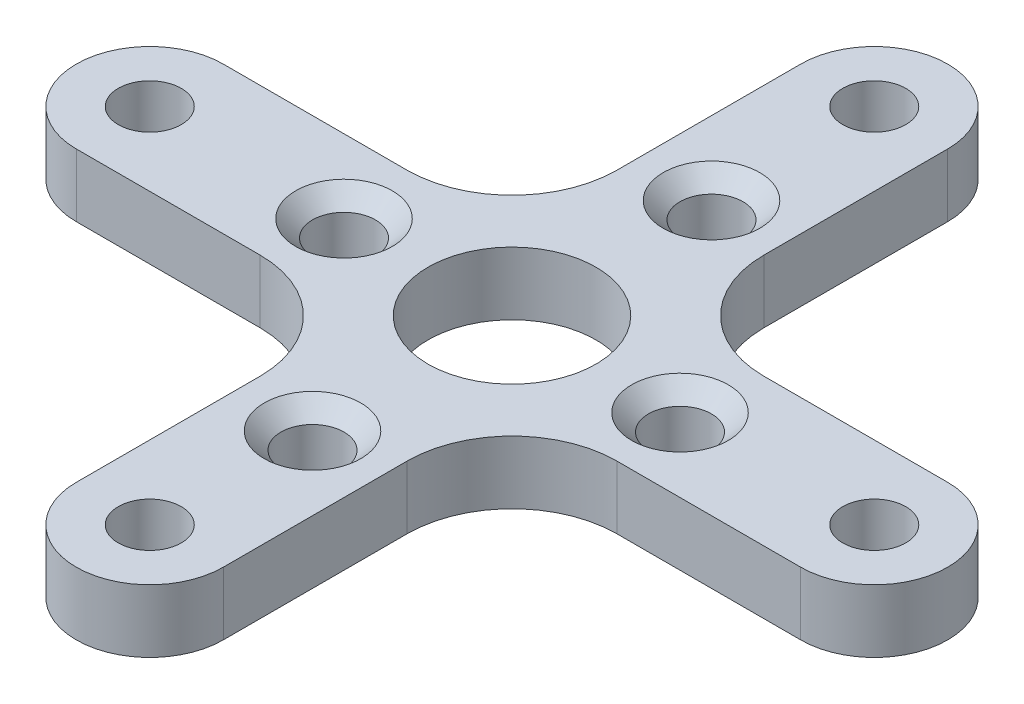
ISO-10303-21;
HEADER;
FILE_DESCRIPTION(('STEP AP214'),'2;1');
FILE_NAME('part.step','',(''),(''),'','','');
FILE_SCHEMA(('AUTOMOTIVE_DESIGN { 1 0 10303 214 1 1 1 1 }'));
ENDSEC;
DATA;
#1=APPLICATION_CONTEXT('core data for automotive mechanical design processes');
#2=APPLICATION_PROTOCOL_DEFINITION('international standard','automotive_design',2000,#1);
#3=PRODUCT_CONTEXT('',#1,'mechanical');
#4=PRODUCT('Part','Part','',(#3));
#5=PRODUCT_RELATED_PRODUCT_CATEGORY('part','',(#4));
#6=PRODUCT_DEFINITION_FORMATION('','',#4);
#7=PRODUCT_DEFINITION_CONTEXT('part definition',#1,'design');
#8=PRODUCT_DEFINITION('design','',#6,#7);
#9=PRODUCT_DEFINITION_SHAPE('','',#8);
#10=(LENGTH_UNIT() NAMED_UNIT(*) SI_UNIT(.MILLI.,.METRE.));
#11=(NAMED_UNIT(*) PLANE_ANGLE_UNIT() SI_UNIT($,.RADIAN.));
#12=(NAMED_UNIT(*) SI_UNIT($,.STERADIAN.) SOLID_ANGLE_UNIT());
#13=UNCERTAINTY_MEASURE_WITH_UNIT(LENGTH_MEASURE(1.E-05),#10,'distance_accuracy_value','');
#14=(GEOMETRIC_REPRESENTATION_CONTEXT(3) GLOBAL_UNCERTAINTY_ASSIGNED_CONTEXT((#13)) GLOBAL_UNIT_ASSIGNED_CONTEXT((#10,
#11,#12)) REPRESENTATION_CONTEXT('',''));
#15=CARTESIAN_POINT('',(0.,0.,0.));
#16=DIRECTION('',(0.,0.,1.));
#17=DIRECTION('',(1.,0.,0.));
#18=AXIS2_PLACEMENT_3D('',#15,#16,#17);
#19=CARTESIAN_POINT('',(0.,3.,-17.25));
#20=DIRECTION('',(0.,1.,0.));
#21=DIRECTION('',(0.,0.,1.));
#22=AXIS2_PLACEMENT_3D('',#19,#20,#21);
#23=PLANE('',#22);
#24=CARTESIAN_POINT('',(-1.27823540039488E-13,3.,9.5));
#25=DIRECTION('',(0.,1.,0.));
#26=DIRECTION('',(0.,0.,1.));
#27=AXIS2_PLACEMENT_3D('',#24,#25,#26);
#28=CIRCLE('',#27,2.3);
#29=CARTESIAN_POINT('',(-1.27823540039488E-13,3.,11.8));
#30=VERTEX_POINT('',#29);
#31=EDGE_CURVE('E261',#30,#30,#28,.F.);
#32=ORIENTED_EDGE('',*,*,#31,.T.);
#33=EDGE_LOOP('',(#32));
#34=FACE_BOUND('',#33,.T.);
#35=CARTESIAN_POINT('',(-8.,3.,0.));
#36=DIRECTION('',(0.,1.,0.));
#37=DIRECTION('',(0.,0.,1.));
#38=AXIS2_PLACEMENT_3D('',#35,#36,#37);
#39=CIRCLE('',#38,2.3);
#40=CARTESIAN_POINT('',(-8.,3.,2.3));
#41=VERTEX_POINT('',#40);
#42=EDGE_CURVE('E258',#41,#41,#39,.F.);
#43=ORIENTED_EDGE('',*,*,#42,.T.);
#44=EDGE_LOOP('',(#43));
#45=FACE_BOUND('',#44,.T.);
#46=CARTESIAN_POINT('',(8.,3.,0.));
#47=DIRECTION('',(0.,1.,0.));
#48=DIRECTION('',(0.,0.,1.));
#49=AXIS2_PLACEMENT_3D('',#46,#47,#48);
#50=CIRCLE('',#49,2.3);
#51=CARTESIAN_POINT('',(8.,3.,2.29999999999991));
#52=VERTEX_POINT('',#51);
#53=EDGE_CURVE('E255',#52,#52,#50,.F.);
#54=ORIENTED_EDGE('',*,*,#53,.T.);
#55=EDGE_LOOP('',(#54));
#56=FACE_BOUND('',#55,.T.);
#57=CARTESIAN_POINT('',(0.,3.,-9.5));
#58=DIRECTION('',(0.,1.,0.));
#59=DIRECTION('',(0.,0.,1.));
#60=AXIS2_PLACEMENT_3D('',#57,#58,#59);
#61=CIRCLE('',#60,2.3);
#62=CARTESIAN_POINT('',(0.,3.,-7.2));
#63=VERTEX_POINT('',#62);
#64=EDGE_CURVE('E252',#63,#63,#61,.F.);
#65=ORIENTED_EDGE('',*,*,#64,.T.);
#66=EDGE_LOOP('',(#65));
#67=FACE_BOUND('',#66,.T.);
#68=CARTESIAN_POINT('',(-1.21323467928077E-13,3.,17.25));
#69=DIRECTION('',(0.,1.,0.));
#70=DIRECTION('',(0.,0.,1.));
#71=AXIS2_PLACEMENT_3D('',#68,#69,#70);
#72=CIRCLE('',#71,1.5);
#73=CARTESIAN_POINT('',(-1.21323467928077E-13,3.,18.75));
#74=VERTEX_POINT('',#73);
#75=EDGE_CURVE('E392',#74,#74,#72,.T.);
#76=ORIENTED_EDGE('',*,*,#75,.F.);
#77=EDGE_LOOP('',(#76));
#78=FACE_BOUND('',#77,.T.);
#79=CARTESIAN_POINT('',(0.,3.,-17.25));
#80=DIRECTION('',(0.,1.,0.));
#81=DIRECTION('',(0.,0.,1.));
#82=AXIS2_PLACEMENT_3D('',#79,#80,#81);
#83=CIRCLE('',#82,1.5);
#84=CARTESIAN_POINT('',(0.,3.,-15.75));
#85=VERTEX_POINT('',#84);
#86=EDGE_CURVE('E404',#85,#85,#83,.T.);
#87=ORIENTED_EDGE('',*,*,#86,.F.);
#88=EDGE_LOOP('',(#87));
#89=FACE_BOUND('',#88,.T.);
#90=CARTESIAN_POINT('',(0.,3.,-17.25));
#91=DIRECTION('',(0.,1.,0.));
#92=DIRECTION('',(0.,0.,1.));
#93=AXIS2_PLACEMENT_3D('',#90,#91,#92);
#94=CIRCLE('',#93,3.5);
#95=CARTESIAN_POINT('',(3.5,3.,-17.25));
#96=VERTEX_POINT('',#95);
#97=CARTESIAN_POINT('',(-3.5,3.,-17.25));
#98=VERTEX_POINT('',#97);
#99=EDGE_CURVE('E210',#96,#98,#94,.T.);
#100=ORIENTED_EDGE('',*,*,#99,.T.);
#101=DIRECTION('',(0.,0.,1.));
#102=VECTOR('',#101,1.);
#103=CARTESIAN_POINT('',(-3.5,3.,-17.25));
#104=LINE('',#103,#102);
#105=CARTESIAN_POINT('',(-3.5,3.,-8.50000000000005));
#106=VERTEX_POINT('',#105);
#107=EDGE_CURVE('E118',#98,#106,#104,.T.);
#108=ORIENTED_EDGE('',*,*,#107,.T.);
#109=CARTESIAN_POINT('',(-8.5,3.,-8.50000000000009));
#110=DIRECTION('',(0.,-1.,0.));
#111=DIRECTION('',(0.,0.,1.));
#112=AXIS2_PLACEMENT_3D('',#109,#110,#111);
#113=CIRCLE('',#112,5.);
#114=CARTESIAN_POINT('',(-8.50000000000009,3.,-3.50000000000009));
#115=VERTEX_POINT('',#114);
#116=EDGE_CURVE('E416',#106,#115,#113,.T.);
#117=ORIENTED_EDGE('',*,*,#116,.T.);
#118=DIRECTION('',(-1.,0.,0.));
#119=VECTOR('',#118,1.);
#120=CARTESIAN_POINT('',(-17.25,3.,-3.50000000000018));
#121=LINE('',#120,#119);
#122=CARTESIAN_POINT('',(-17.25,3.,-3.50000000000018));
#123=VERTEX_POINT('',#122);
#124=EDGE_CURVE('E418',#115,#123,#121,.T.);
#125=ORIENTED_EDGE('',*,*,#124,.T.);
#126=CARTESIAN_POINT('',(-17.25,3.,-1.80684159285132E-13));
#127=DIRECTION('',(0.,1.,0.));
#128=DIRECTION('',(0.,0.,1.));
#129=AXIS2_PLACEMENT_3D('',#126,#127,#128);
#130=CIRCLE('',#129,3.5);
#131=CARTESIAN_POINT('',(-17.25,3.,3.49999999999982));
#132=VERTEX_POINT('',#131);
#133=EDGE_CURVE('E420',#123,#132,#130,.T.);
#134=ORIENTED_EDGE('',*,*,#133,.T.);
#135=DIRECTION('',(1.,0.,0.));
#136=VECTOR('',#135,1.);
#137=CARTESIAN_POINT('',(-17.25,3.,3.49999999999982));
#138=LINE('',#137,#136);
#139=CARTESIAN_POINT('',(-8.50000000000004,3.,3.49999999999991));
#140=VERTEX_POINT('',#139);
#141=EDGE_CURVE('E422',#132,#140,#138,.T.);
#142=ORIENTED_EDGE('',*,*,#141,.T.);
#143=CARTESIAN_POINT('',(-8.50000000000006,3.,8.49999999999991));
#144=DIRECTION('',(0.,-1.,0.));
#145=DIRECTION('',(0.,0.,-1.));
#146=AXIS2_PLACEMENT_3D('',#143,#144,#145);
#147=CIRCLE('',#146,5.);
#148=CARTESIAN_POINT('',(-3.50000000000006,3.,8.49999999999998));
#149=VERTEX_POINT('',#148);
#150=EDGE_CURVE('E424',#140,#149,#147,.T.);
#151=ORIENTED_EDGE('',*,*,#150,.T.);
#152=DIRECTION('',(0.,0.,1.));
#153=VECTOR('',#152,1.);
#154=CARTESIAN_POINT('',(-3.50000000000012,3.,17.25));
#155=LINE('',#154,#153);
#156=CARTESIAN_POINT('',(-3.50000000000012,3.,17.25));
#157=VERTEX_POINT('',#156);
#158=EDGE_CURVE('E426',#149,#157,#155,.T.);
#159=ORIENTED_EDGE('',*,*,#158,.T.);
#160=CARTESIAN_POINT('',(-1.21323467928077E-13,3.,17.25));
#161=DIRECTION('',(0.,1.,0.));
#162=DIRECTION('',(0.,0.,1.));
#163=AXIS2_PLACEMENT_3D('',#160,#161,#162);
#164=CIRCLE('',#163,3.5);
#165=CARTESIAN_POINT('',(3.49999999999988,3.,17.25));
#166=VERTEX_POINT('',#165);
#167=EDGE_CURVE('E428',#157,#166,#164,.T.);
#168=ORIENTED_EDGE('',*,*,#167,.T.);
#169=DIRECTION('',(0.,0.,-1.));
#170=VECTOR('',#169,1.);
#171=CARTESIAN_POINT('',(3.49999999999988,3.,17.25));
#172=LINE('',#171,#170);
#173=CARTESIAN_POINT('',(3.49999999999994,3.,8.50000000000003));
#174=VERTEX_POINT('',#173);
#175=EDGE_CURVE('E430',#166,#174,#172,.T.);
#176=ORIENTED_EDGE('',*,*,#175,.T.);
#177=CARTESIAN_POINT('',(8.49999999999994,3.,8.50000000000003));
#178=DIRECTION('',(0.,-1.,0.));
#179=DIRECTION('',(0.,0.,-1.));
#180=AXIS2_PLACEMENT_3D('',#177,#178,#179);
#181=CIRCLE('',#180,4.99999999999998);
#182=CARTESIAN_POINT('',(8.49999999999994,3.,3.50000000000005));
#183=VERTEX_POINT('',#182);
#184=EDGE_CURVE('E432',#174,#183,#181,.T.);
#185=ORIENTED_EDGE('',*,*,#184,.T.);
#186=DIRECTION('',(1.,0.,0.));
#187=VECTOR('',#186,1.);
#188=CARTESIAN_POINT('',(17.25,3.,3.50000000000006));
#189=LINE('',#188,#187);
#190=CARTESIAN_POINT('',(17.25,3.,3.50000000000006));
#191=VERTEX_POINT('',#190);
#192=EDGE_CURVE('E434',#183,#191,#189,.T.);
#193=ORIENTED_EDGE('',*,*,#192,.T.);
#194=CARTESIAN_POINT('',(17.25,3.,0.));
#195=DIRECTION('',(0.,1.,0.));
#196=DIRECTION('',(0.,0.,1.));
#197=AXIS2_PLACEMENT_3D('',#194,#195,#196);
#198=CIRCLE('',#197,3.5);
#199=CARTESIAN_POINT('',(17.25,3.,-3.49999999999994));
#200=VERTEX_POINT('',#199);
#201=EDGE_CURVE('E161',#191,#200,#198,.T.);
#202=ORIENTED_EDGE('',*,*,#201,.T.);
#203=DIRECTION('',(-1.,0.,0.));
#204=VECTOR('',#203,1.);
#205=CARTESIAN_POINT('',(17.25,3.,-3.49999999999994));
#206=LINE('',#205,#204);
#207=CARTESIAN_POINT('',(8.5,3.,-3.49999999999994));
#208=VERTEX_POINT('',#207);
#209=EDGE_CURVE('E155',#200,#208,#206,.T.);
#210=ORIENTED_EDGE('',*,*,#209,.T.);
#211=CARTESIAN_POINT('',(8.5,3.,-8.49999999999997));
#212=DIRECTION('',(0.,-1.,0.));
#213=DIRECTION('',(0.,0.,-1.));
#214=AXIS2_PLACEMENT_3D('',#211,#212,#213);
#215=CIRCLE('',#214,5.00000000000002);
#216=CARTESIAN_POINT('',(3.49999999999999,3.,-8.49999999999994));
#217=VERTEX_POINT('',#216);
#218=EDGE_CURVE('E159',#208,#217,#215,.T.);
#219=ORIENTED_EDGE('',*,*,#218,.T.);
#220=DIRECTION('',(0.,0.,-1.));
#221=VECTOR('',#220,1.);
#222=CARTESIAN_POINT('',(3.5,3.,-17.25));
#223=LINE('',#222,#221);
#224=EDGE_CURVE('E50',#217,#96,#223,.T.);
#225=ORIENTED_EDGE('',*,*,#224,.T.);
#226=EDGE_LOOP('',(#100,#108,#117,#125,#134,#142,#151,#159,#168,#176,#185,#193,#202,#210,#219,#225));
#227=FACE_BOUND('',#226,.T.);
#228=CARTESIAN_POINT('',(0.,3.,0.));
#229=DIRECTION('',(0.,1.,0.));
#230=DIRECTION('',(0.,0.,1.));
#231=AXIS2_PLACEMENT_3D('',#228,#229,#230);
#232=CIRCLE('',#231,4.);
#233=CARTESIAN_POINT('',(0.,3.,4.));
#234=VERTEX_POINT('',#233);
#235=EDGE_CURVE('E183',#234,#234,#232,.T.);
#236=ORIENTED_EDGE('',*,*,#235,.F.);
#237=EDGE_LOOP('',(#236));
#238=FACE_BOUND('',#237,.T.);
#239=CARTESIAN_POINT('',(17.25,3.,0.));
#240=DIRECTION('',(0.,1.,0.));
#241=DIRECTION('',(0.,0.,1.));
#242=AXIS2_PLACEMENT_3D('',#239,#240,#241);
#243=CIRCLE('',#242,1.5);
#244=CARTESIAN_POINT('',(17.25,3.,1.50000000000006));
#245=VERTEX_POINT('',#244);
#246=EDGE_CURVE('E398',#245,#245,#243,.T.);
#247=ORIENTED_EDGE('',*,*,#246,.F.);
#248=EDGE_LOOP('',(#247));
#249=FACE_BOUND('',#248,.T.);
#250=CARTESIAN_POINT('',(-17.25,3.,-1.80684159285132E-13));
#251=DIRECTION('',(0.,1.,0.));
#252=DIRECTION('',(0.,0.,1.));
#253=AXIS2_PLACEMENT_3D('',#250,#251,#252);
#254=CIRCLE('',#253,1.5);
#255=CARTESIAN_POINT('',(-17.25,3.,1.49999999999982));
#256=VERTEX_POINT('',#255);
#257=EDGE_CURVE('E386',#256,#256,#254,.T.);
#258=ORIENTED_EDGE('',*,*,#257,.F.);
#259=EDGE_LOOP('',(#258));
#260=FACE_BOUND('',#259,.T.);
#261=ADVANCED_FACE('F33',(#34,#45,#56,#67,#78,#89,#227,#238,#249,#260),#23,.T.);
#262=CARTESIAN_POINT('',(0.,0.,-17.25));
#263=DIRECTION('',(0.,1.,0.));
#264=DIRECTION('',(0.,0.,1.));
#265=AXIS2_PLACEMENT_3D('',#262,#263,#264);
#266=PLANE('',#265);
#267=CARTESIAN_POINT('',(0.,0.,-17.25));
#268=DIRECTION('',(0.,1.,0.));
#269=DIRECTION('',(0.,0.,1.));
#270=AXIS2_PLACEMENT_3D('',#267,#268,#269);
#271=CIRCLE('',#270,3.5);
#272=CARTESIAN_POINT('',(3.5,0.,-17.25));
#273=VERTEX_POINT('',#272);
#274=CARTESIAN_POINT('',(-3.5,0.,-17.25));
#275=VERTEX_POINT('',#274);
#276=EDGE_CURVE('E179',#273,#275,#271,.T.);
#277=ORIENTED_EDGE('',*,*,#276,.F.);
#278=DIRECTION('',(0.,0.,-1.));
#279=VECTOR('',#278,1.);
#280=CARTESIAN_POINT('',(3.5,0.,-17.25));
#281=LINE('',#280,#279);
#282=CARTESIAN_POINT('',(3.49999999999999,0.,-8.49999999999994));
#283=VERTEX_POINT('',#282);
#284=EDGE_CURVE('E109',#283,#273,#281,.T.);
#285=ORIENTED_EDGE('',*,*,#284,.F.);
#286=CARTESIAN_POINT('',(8.5,0.,-8.49999999999997));
#287=DIRECTION('',(0.,-1.,0.));
#288=DIRECTION('',(0.,0.,-1.));
#289=AXIS2_PLACEMENT_3D('',#286,#287,#288);
#290=CIRCLE('',#289,5.00000000000002);
#291=CARTESIAN_POINT('',(8.5,0.,-3.49999999999994));
#292=VERTEX_POINT('',#291);
#293=EDGE_CURVE('E103',#292,#283,#290,.T.);
#294=ORIENTED_EDGE('',*,*,#293,.F.);
#295=DIRECTION('',(-1.,0.,0.));
#296=VECTOR('',#295,1.);
#297=CARTESIAN_POINT('',(17.25,0.,-3.49999999999994));
#298=LINE('',#297,#296);
#299=CARTESIAN_POINT('',(17.25,0.,-3.49999999999994));
#300=VERTEX_POINT('',#299);
#301=EDGE_CURVE('E169',#300,#292,#298,.T.);
#302=ORIENTED_EDGE('',*,*,#301,.F.);
#303=CARTESIAN_POINT('',(17.25,0.,0.));
#304=DIRECTION('',(0.,1.,0.));
#305=DIRECTION('',(0.,0.,1.));
#306=AXIS2_PLACEMENT_3D('',#303,#304,#305);
#307=CIRCLE('',#306,3.5);
#308=CARTESIAN_POINT('',(17.25,0.,3.50000000000006));
#309=VERTEX_POINT('',#308);
#310=EDGE_CURVE('E205',#309,#300,#307,.T.);
#311=ORIENTED_EDGE('',*,*,#310,.F.);
#312=DIRECTION('',(1.,0.,0.));
#313=VECTOR('',#312,1.);
#314=CARTESIAN_POINT('',(17.25,0.,3.50000000000006));
#315=LINE('',#314,#313);
#316=CARTESIAN_POINT('',(8.49999999999994,0.,3.50000000000005));
#317=VERTEX_POINT('',#316);
#318=EDGE_CURVE('E203',#317,#309,#315,.T.);
#319=ORIENTED_EDGE('',*,*,#318,.F.);
#320=CARTESIAN_POINT('',(8.49999999999994,0.,8.50000000000003));
#321=DIRECTION('',(0.,-1.,0.));
#322=DIRECTION('',(0.,0.,-1.));
#323=AXIS2_PLACEMENT_3D('',#320,#321,#322);
#324=CIRCLE('',#323,4.99999999999998);
#325=CARTESIAN_POINT('',(3.49999999999994,0.,8.50000000000003));
#326=VERTEX_POINT('',#325);
#327=EDGE_CURVE('E201',#326,#317,#324,.T.);
#328=ORIENTED_EDGE('',*,*,#327,.F.);
#329=DIRECTION('',(0.,0.,-1.));
#330=VECTOR('',#329,1.);
#331=CARTESIAN_POINT('',(3.49999999999988,0.,17.25));
#332=LINE('',#331,#330);
#333=CARTESIAN_POINT('',(3.49999999999988,0.,17.25));
#334=VERTEX_POINT('',#333);
#335=EDGE_CURVE('E199',#334,#326,#332,.T.);
#336=ORIENTED_EDGE('',*,*,#335,.F.);
#337=CARTESIAN_POINT('',(-1.21323467928077E-13,0.,17.25));
#338=DIRECTION('',(0.,1.,0.));
#339=DIRECTION('',(0.,0.,1.));
#340=AXIS2_PLACEMENT_3D('',#337,#338,#339);
#341=CIRCLE('',#340,3.5);
#342=CARTESIAN_POINT('',(-3.50000000000012,0.,17.25));
#343=VERTEX_POINT('',#342);
#344=EDGE_CURVE('E197',#343,#334,#341,.T.);
#345=ORIENTED_EDGE('',*,*,#344,.F.);
#346=DIRECTION('',(0.,0.,1.));
#347=VECTOR('',#346,1.);
#348=CARTESIAN_POINT('',(-3.50000000000012,0.,17.25));
#349=LINE('',#348,#347);
#350=CARTESIAN_POINT('',(-3.50000000000006,0.,8.49999999999998));
#351=VERTEX_POINT('',#350);
#352=EDGE_CURVE('E195',#351,#343,#349,.T.);
#353=ORIENTED_EDGE('',*,*,#352,.F.);
#354=CARTESIAN_POINT('',(-8.50000000000006,0.,8.49999999999991));
#355=DIRECTION('',(0.,-1.,0.));
#356=DIRECTION('',(0.,0.,-1.));
#357=AXIS2_PLACEMENT_3D('',#354,#355,#356);
#358=CIRCLE('',#357,5.);
#359=CARTESIAN_POINT('',(-8.50000000000004,0.,3.49999999999991));
#360=VERTEX_POINT('',#359);
#361=EDGE_CURVE('E193',#360,#351,#358,.T.);
#362=ORIENTED_EDGE('',*,*,#361,.F.);
#363=DIRECTION('',(1.,0.,0.));
#364=VECTOR('',#363,1.);
#365=CARTESIAN_POINT('',(-17.25,0.,3.49999999999982));
#366=LINE('',#365,#364);
#367=CARTESIAN_POINT('',(-17.25,0.,3.49999999999982));
#368=VERTEX_POINT('',#367);
#369=EDGE_CURVE('E191',#368,#360,#366,.T.);
#370=ORIENTED_EDGE('',*,*,#369,.F.);
#371=CARTESIAN_POINT('',(-17.25,0.,-1.80684159285132E-13));
#372=DIRECTION('',(0.,1.,0.));
#373=DIRECTION('',(0.,0.,1.));
#374=AXIS2_PLACEMENT_3D('',#371,#372,#373);
#375=CIRCLE('',#374,3.5);
#376=CARTESIAN_POINT('',(-17.25,0.,-3.50000000000018));
#377=VERTEX_POINT('',#376);
#378=EDGE_CURVE('E189',#377,#368,#375,.T.);
#379=ORIENTED_EDGE('',*,*,#378,.F.);
#380=DIRECTION('',(-1.,0.,0.));
#381=VECTOR('',#380,1.);
#382=CARTESIAN_POINT('',(-17.25,0.,-3.50000000000018));
#383=LINE('',#382,#381);
#384=CARTESIAN_POINT('',(-8.50000000000009,0.,-3.50000000000009));
#385=VERTEX_POINT('',#384);
#386=EDGE_CURVE('E187',#385,#377,#383,.T.);
#387=ORIENTED_EDGE('',*,*,#386,.F.);
#388=CARTESIAN_POINT('',(-8.5,0.,-8.50000000000009));
#389=DIRECTION('',(0.,-1.,0.));
#390=DIRECTION('',(0.,0.,1.));
#391=AXIS2_PLACEMENT_3D('',#388,#389,#390);
#392=CIRCLE('',#391,5.);
#393=CARTESIAN_POINT('',(-3.5,0.,-8.50000000000005));
#394=VERTEX_POINT('',#393);
#395=EDGE_CURVE('E185',#394,#385,#392,.T.);
#396=ORIENTED_EDGE('',*,*,#395,.F.);
#397=DIRECTION('',(0.,0.,1.));
#398=VECTOR('',#397,1.);
#399=CARTESIAN_POINT('',(-3.5,0.,-17.25));
#400=LINE('',#399,#398);
#401=EDGE_CURVE('E182',#275,#394,#400,.T.);
#402=ORIENTED_EDGE('',*,*,#401,.F.);
#403=EDGE_LOOP('',(#277,#285,#294,#302,#311,#319,#328,#336,#345,#353,#362,#370,#379,#387,#396,#402));
#404=FACE_BOUND('',#403,.T.);
#405=CARTESIAN_POINT('',(0.,0.,0.));
#406=DIRECTION('',(0.,1.,0.));
#407=DIRECTION('',(0.,0.,1.));
#408=AXIS2_PLACEMENT_3D('',#405,#406,#407);
#409=CIRCLE('',#408,4.);
#410=CARTESIAN_POINT('',(0.,0.,4.));
#411=VERTEX_POINT('',#410);
#412=EDGE_CURVE('E407',#411,#411,#409,.T.);
#413=ORIENTED_EDGE('',*,*,#412,.T.);
#414=EDGE_LOOP('',(#413));
#415=FACE_BOUND('',#414,.T.);
#416=CARTESIAN_POINT('',(0.,0.,-17.25));
#417=DIRECTION('',(0.,1.,0.));
#418=DIRECTION('',(0.,0.,1.));
#419=AXIS2_PLACEMENT_3D('',#416,#417,#418);
#420=CIRCLE('',#419,1.5);
#421=CARTESIAN_POINT('',(0.,0.,-15.75));
#422=VERTEX_POINT('',#421);
#423=EDGE_CURVE('E401',#422,#422,#420,.T.);
#424=ORIENTED_EDGE('',*,*,#423,.T.);
#425=EDGE_LOOP('',(#424));
#426=FACE_BOUND('',#425,.T.);
#427=CARTESIAN_POINT('',(17.25,0.,0.));
#428=DIRECTION('',(0.,1.,0.));
#429=DIRECTION('',(0.,0.,1.));
#430=AXIS2_PLACEMENT_3D('',#427,#428,#429);
#431=CIRCLE('',#430,1.5);
#432=CARTESIAN_POINT('',(17.25,0.,1.50000000000006));
#433=VERTEX_POINT('',#432);
#434=EDGE_CURVE('E395',#433,#433,#431,.T.);
#435=ORIENTED_EDGE('',*,*,#434,.T.);
#436=EDGE_LOOP('',(#435));
#437=FACE_BOUND('',#436,.T.);
#438=CARTESIAN_POINT('',(-1.21323467928077E-13,0.,17.25));
#439=DIRECTION('',(0.,1.,0.));
#440=DIRECTION('',(0.,0.,1.));
#441=AXIS2_PLACEMENT_3D('',#438,#439,#440);
#442=CIRCLE('',#441,1.5);
#443=CARTESIAN_POINT('',(-1.21323467928077E-13,0.,18.75));
#444=VERTEX_POINT('',#443);
#445=EDGE_CURVE('E389',#444,#444,#442,.T.);
#446=ORIENTED_EDGE('',*,*,#445,.T.);
#447=EDGE_LOOP('',(#446));
#448=FACE_BOUND('',#447,.T.);
#449=CARTESIAN_POINT('',(-17.25,0.,-1.80684159285132E-13));
#450=DIRECTION('',(0.,1.,0.));
#451=DIRECTION('',(0.,0.,1.));
#452=AXIS2_PLACEMENT_3D('',#449,#450,#451);
#453=CIRCLE('',#452,1.5);
#454=CARTESIAN_POINT('',(-17.25,0.,1.49999999999982));
#455=VERTEX_POINT('',#454);
#456=EDGE_CURVE('E385',#455,#455,#453,.T.);
#457=ORIENTED_EDGE('',*,*,#456,.T.);
#458=EDGE_LOOP('',(#457));
#459=FACE_BOUND('',#458,.T.);
#460=CARTESIAN_POINT('',(-8.,0.,0.));
#461=DIRECTION('',(0.,1.,0.));
#462=DIRECTION('',(0.,0.,1.));
#463=AXIS2_PLACEMENT_3D('',#460,#461,#462);
#464=CIRCLE('',#463,1.5);
#465=CARTESIAN_POINT('',(-8.,0.,1.5));
#466=VERTEX_POINT('',#465);
#467=EDGE_CURVE('E382',#466,#466,#464,.T.);
#468=ORIENTED_EDGE('',*,*,#467,.T.);
#469=EDGE_LOOP('',(#468));
#470=FACE_BOUND('',#469,.T.);
#471=CARTESIAN_POINT('',(8.,0.,0.));
#472=DIRECTION('',(0.,1.,0.));
#473=DIRECTION('',(0.,0.,1.));
#474=AXIS2_PLACEMENT_3D('',#471,#472,#473);
#475=CIRCLE('',#474,1.5);
#476=CARTESIAN_POINT('',(8.,0.,1.49999999999991));
#477=VERTEX_POINT('',#476);
#478=EDGE_CURVE('E377',#477,#477,#475,.T.);
#479=ORIENTED_EDGE('',*,*,#478,.T.);
#480=EDGE_LOOP('',(#479));
#481=FACE_BOUND('',#480,.T.);
#482=CARTESIAN_POINT('',(0.,0.,-9.5));
#483=DIRECTION('',(0.,1.,0.));
#484=DIRECTION('',(0.,0.,1.));
#485=AXIS2_PLACEMENT_3D('',#482,#483,#484);
#486=CIRCLE('',#485,1.5);
#487=CARTESIAN_POINT('',(0.,0.,-8.));
#488=VERTEX_POINT('',#487);
#489=EDGE_CURVE('E374',#488,#488,#486,.T.);
#490=ORIENTED_EDGE('',*,*,#489,.T.);
#491=EDGE_LOOP('',(#490));
#492=FACE_BOUND('',#491,.T.);
#493=CARTESIAN_POINT('',(-1.27823540039488E-13,0.,9.5));
#494=DIRECTION('',(0.,1.,0.));
#495=DIRECTION('',(0.,0.,1.));
#496=AXIS2_PLACEMENT_3D('',#493,#494,#495);
#497=CIRCLE('',#496,1.5);
#498=CARTESIAN_POINT('',(-1.27823540039488E-13,0.,11.));
#499=VERTEX_POINT('',#498);
#500=EDGE_CURVE('E372',#499,#499,#497,.T.);
#501=ORIENTED_EDGE('',*,*,#500,.T.);
#502=EDGE_LOOP('',(#501));
#503=FACE_BOUND('',#502,.T.);
#504=ADVANCED_FACE('F286',(#404,#415,#426,#437,#448,#459,#470,#481,#492,#503),#266,.F.);
#505=CARTESIAN_POINT('',(0.,3.,-17.25));
#506=DIRECTION('',(0.,-1.,0.));
#507=DIRECTION('',(0.,0.,-1.));
#508=AXIS2_PLACEMENT_3D('',#505,#506,#507);
#509=CYLINDRICAL_SURFACE('',#508,3.5);
#510=ORIENTED_EDGE('',*,*,#276,.T.);
#511=DIRECTION('',(0.,-1.,0.));
#512=VECTOR('',#511,1.);
#513=CARTESIAN_POINT('',(-3.5,3.,-17.25));
#514=LINE('',#513,#512);
#515=EDGE_CURVE('E247',#98,#275,#514,.T.);
#516=ORIENTED_EDGE('',*,*,#515,.F.);
#517=ORIENTED_EDGE('',*,*,#99,.F.);
#518=DIRECTION('',(0.,-1.,0.));
#519=VECTOR('',#518,1.);
#520=CARTESIAN_POINT('',(3.5,3.,-17.25));
#521=LINE('',#520,#519);
#522=EDGE_CURVE('E175',#96,#273,#521,.T.);
#523=ORIENTED_EDGE('',*,*,#522,.T.);
#524=EDGE_LOOP('',(#510,#516,#517,#523));
#525=FACE_BOUND('',#524,.T.);
#526=ADVANCED_FACE('F292',(#525),#509,.T.);
#527=CARTESIAN_POINT('',(-3.5,3.,-17.25));
#528=DIRECTION('',(1.,0.,0.));
#529=DIRECTION('',(0.,0.,-1.));
#530=AXIS2_PLACEMENT_3D('',#527,#528,#529);
#531=PLANE('',#530);
#532=ORIENTED_EDGE('',*,*,#401,.T.);
#533=DIRECTION('',(0.,-1.,0.));
#534=VECTOR('',#533,1.);
#535=CARTESIAN_POINT('',(-3.5,3.,-8.50000000000005));
#536=LINE('',#535,#534);
#537=EDGE_CURVE('E244',#106,#394,#536,.T.);
#538=ORIENTED_EDGE('',*,*,#537,.F.);
#539=ORIENTED_EDGE('',*,*,#107,.F.);
#540=ORIENTED_EDGE('',*,*,#515,.T.);
#541=EDGE_LOOP('',(#532,#538,#539,#540));
#542=FACE_BOUND('',#541,.T.);
#543=ADVANCED_FACE('F350',(#542),#531,.F.);
#544=CARTESIAN_POINT('',(-8.5,3.,-8.50000000000009));
#545=DIRECTION('',(0.,-1.,0.));
#546=DIRECTION('',(0.,0.,-1.));
#547=AXIS2_PLACEMENT_3D('',#544,#545,#546);
#548=CYLINDRICAL_SURFACE('',#547,5.);
#549=ORIENTED_EDGE('',*,*,#395,.T.);
#550=DIRECTION('',(0.,-1.,0.));
#551=VECTOR('',#550,1.);
#552=CARTESIAN_POINT('',(-8.50000000000009,3.,-3.50000000000009));
#553=LINE('',#552,#551);
#554=EDGE_CURVE('E241',#115,#385,#553,.T.);
#555=ORIENTED_EDGE('',*,*,#554,.F.);
#556=ORIENTED_EDGE('',*,*,#116,.F.);
#557=ORIENTED_EDGE('',*,*,#537,.T.);
#558=EDGE_LOOP('',(#549,#555,#556,#557));
#559=FACE_BOUND('',#558,.T.);
#560=ADVANCED_FACE('F346',(#559),#548,.F.);
#561=CARTESIAN_POINT('',(-17.25,3.,-3.50000000000018));
#562=DIRECTION('',(0.,0.,1.));
#563=DIRECTION('',(1.,0.,0.));
#564=AXIS2_PLACEMENT_3D('',#561,#562,#563);
#565=PLANE('',#564);
#566=ORIENTED_EDGE('',*,*,#386,.T.);
#567=DIRECTION('',(0.,-1.,0.));
#568=VECTOR('',#567,1.);
#569=CARTESIAN_POINT('',(-17.25,3.,-3.50000000000018));
#570=LINE('',#569,#568);
#571=EDGE_CURVE('E238',#123,#377,#570,.T.);
#572=ORIENTED_EDGE('',*,*,#571,.F.);
#573=ORIENTED_EDGE('',*,*,#124,.F.);
#574=ORIENTED_EDGE('',*,*,#554,.T.);
#575=EDGE_LOOP('',(#566,#572,#573,#574));
#576=FACE_BOUND('',#575,.T.);
#577=ADVANCED_FACE('F342',(#576),#565,.F.);
#578=CARTESIAN_POINT('',(-17.25,3.,-1.80684159285132E-13));
#579=DIRECTION('',(0.,-1.,0.));
#580=DIRECTION('',(0.,0.,-1.));
#581=AXIS2_PLACEMENT_3D('',#578,#579,#580);
#582=CYLINDRICAL_SURFACE('',#581,3.5);
#583=ORIENTED_EDGE('',*,*,#378,.T.);
#584=DIRECTION('',(0.,-1.,0.));
#585=VECTOR('',#584,1.);
#586=CARTESIAN_POINT('',(-17.25,3.,3.49999999999982));
#587=LINE('',#586,#585);
#588=EDGE_CURVE('E235',#132,#368,#587,.T.);
#589=ORIENTED_EDGE('',*,*,#588,.F.);
#590=ORIENTED_EDGE('',*,*,#133,.F.);
#591=ORIENTED_EDGE('',*,*,#571,.T.);
#592=EDGE_LOOP('',(#583,#589,#590,#591));
#593=FACE_BOUND('',#592,.T.);
#594=ADVANCED_FACE('F338',(#593),#582,.T.);
#595=CARTESIAN_POINT('',(-17.25,3.,3.49999999999982));
#596=DIRECTION('',(0.,0.,-1.));
#597=DIRECTION('',(-1.,0.,0.));
#598=AXIS2_PLACEMENT_3D('',#595,#596,#597);
#599=PLANE('',#598);
#600=ORIENTED_EDGE('',*,*,#369,.T.);
#601=DIRECTION('',(0.,-1.,0.));
#602=VECTOR('',#601,1.);
#603=CARTESIAN_POINT('',(-8.50000000000004,3.,3.49999999999991));
#604=LINE('',#603,#602);
#605=EDGE_CURVE('E232',#140,#360,#604,.T.);
#606=ORIENTED_EDGE('',*,*,#605,.F.);
#607=ORIENTED_EDGE('',*,*,#141,.F.);
#608=ORIENTED_EDGE('',*,*,#588,.T.);
#609=EDGE_LOOP('',(#600,#606,#607,#608));
#610=FACE_BOUND('',#609,.T.);
#611=ADVANCED_FACE('F334',(#610),#599,.F.);
#612=CARTESIAN_POINT('',(-8.50000000000006,3.,8.49999999999991));
#613=DIRECTION('',(0.,-1.,0.));
#614=DIRECTION('',(0.,0.,-1.));
#615=AXIS2_PLACEMENT_3D('',#612,#613,#614);
#616=CYLINDRICAL_SURFACE('',#615,5.);
#617=ORIENTED_EDGE('',*,*,#361,.T.);
#618=DIRECTION('',(0.,-1.,0.));
#619=VECTOR('',#618,1.);
#620=CARTESIAN_POINT('',(-3.50000000000006,3.,8.49999999999998));
#621=LINE('',#620,#619);
#622=EDGE_CURVE('E229',#149,#351,#621,.T.);
#623=ORIENTED_EDGE('',*,*,#622,.F.);
#624=ORIENTED_EDGE('',*,*,#150,.F.);
#625=ORIENTED_EDGE('',*,*,#605,.T.);
#626=EDGE_LOOP('',(#617,#623,#624,#625));
#627=FACE_BOUND('',#626,.T.);
#628=ADVANCED_FACE('F330',(#627),#616,.F.);
#629=CARTESIAN_POINT('',(-3.50000000000012,3.,17.25));
#630=DIRECTION('',(1.,0.,0.));
#631=DIRECTION('',(0.,0.,-1.));
#632=AXIS2_PLACEMENT_3D('',#629,#630,#631);
#633=PLANE('',#632);
#634=ORIENTED_EDGE('',*,*,#352,.T.);
#635=DIRECTION('',(0.,-1.,0.));
#636=VECTOR('',#635,1.);
#637=CARTESIAN_POINT('',(-3.50000000000012,3.,17.25));
#638=LINE('',#637,#636);
#639=EDGE_CURVE('E226',#157,#343,#638,.T.);
#640=ORIENTED_EDGE('',*,*,#639,.F.);
#641=ORIENTED_EDGE('',*,*,#158,.F.);
#642=ORIENTED_EDGE('',*,*,#622,.T.);
#643=EDGE_LOOP('',(#634,#640,#641,#642));
#644=FACE_BOUND('',#643,.T.);
#645=ADVANCED_FACE('F326',(#644),#633,.F.);
#646=CARTESIAN_POINT('',(-1.21323467928077E-13,3.,17.25));
#647=DIRECTION('',(0.,-1.,0.));
#648=DIRECTION('',(0.,0.,-1.));
#649=AXIS2_PLACEMENT_3D('',#646,#647,#648);
#650=CYLINDRICAL_SURFACE('',#649,3.5);
#651=ORIENTED_EDGE('',*,*,#344,.T.);
#652=DIRECTION('',(0.,-1.,0.));
#653=VECTOR('',#652,1.);
#654=CARTESIAN_POINT('',(3.49999999999988,3.,17.25));
#655=LINE('',#654,#653);
#656=EDGE_CURVE('E223',#166,#334,#655,.T.);
#657=ORIENTED_EDGE('',*,*,#656,.F.);
#658=ORIENTED_EDGE('',*,*,#167,.F.);
#659=ORIENTED_EDGE('',*,*,#639,.T.);
#660=EDGE_LOOP('',(#651,#657,#658,#659));
#661=FACE_BOUND('',#660,.T.);
#662=ADVANCED_FACE('F322',(#661),#650,.T.);
#663=CARTESIAN_POINT('',(3.49999999999988,3.,17.25));
#664=DIRECTION('',(-1.,0.,0.));
#665=DIRECTION('',(0.,0.,1.));
#666=AXIS2_PLACEMENT_3D('',#663,#664,#665);
#667=PLANE('',#666);
#668=ORIENTED_EDGE('',*,*,#335,.T.);
#669=DIRECTION('',(0.,-1.,0.));
#670=VECTOR('',#669,1.);
#671=CARTESIAN_POINT('',(3.49999999999994,3.,8.50000000000003));
#672=LINE('',#671,#670);
#673=EDGE_CURVE('E220',#174,#326,#672,.T.);
#674=ORIENTED_EDGE('',*,*,#673,.F.);
#675=ORIENTED_EDGE('',*,*,#175,.F.);
#676=ORIENTED_EDGE('',*,*,#656,.T.);
#677=EDGE_LOOP('',(#668,#674,#675,#676));
#678=FACE_BOUND('',#677,.T.);
#679=ADVANCED_FACE('F318',(#678),#667,.F.);
#680=CARTESIAN_POINT('',(8.49999999999994,3.,8.50000000000003));
#681=DIRECTION('',(0.,-1.,0.));
#682=DIRECTION('',(0.,0.,-1.));
#683=AXIS2_PLACEMENT_3D('',#680,#681,#682);
#684=CYLINDRICAL_SURFACE('',#683,4.99999999999998);
#685=ORIENTED_EDGE('',*,*,#327,.T.);
#686=DIRECTION('',(0.,-1.,0.));
#687=VECTOR('',#686,1.);
#688=CARTESIAN_POINT('',(8.49999999999994,3.,3.50000000000005));
#689=LINE('',#688,#687);
#690=EDGE_CURVE('E217',#183,#317,#689,.T.);
#691=ORIENTED_EDGE('',*,*,#690,.F.);
#692=ORIENTED_EDGE('',*,*,#184,.F.);
#693=ORIENTED_EDGE('',*,*,#673,.T.);
#694=EDGE_LOOP('',(#685,#691,#692,#693));
#695=FACE_BOUND('',#694,.T.);
#696=ADVANCED_FACE('F314',(#695),#684,.F.);
#697=CARTESIAN_POINT('',(17.25,3.,3.50000000000006));
#698=DIRECTION('',(0.,0.,-1.));
#699=DIRECTION('',(-1.,0.,0.));
#700=AXIS2_PLACEMENT_3D('',#697,#698,#699);
#701=PLANE('',#700);
#702=ORIENTED_EDGE('',*,*,#318,.T.);
#703=DIRECTION('',(0.,-1.,0.));
#704=VECTOR('',#703,1.);
#705=CARTESIAN_POINT('',(17.25,3.,3.50000000000006));
#706=LINE('',#705,#704);
#707=EDGE_CURVE('E214',#191,#309,#706,.T.);
#708=ORIENTED_EDGE('',*,*,#707,.F.);
#709=ORIENTED_EDGE('',*,*,#192,.F.);
#710=ORIENTED_EDGE('',*,*,#690,.T.);
#711=EDGE_LOOP('',(#702,#708,#709,#710));
#712=FACE_BOUND('',#711,.T.);
#713=ADVANCED_FACE('F310',(#712),#701,.F.);
#714=CARTESIAN_POINT('',(17.25,3.,0.));
#715=DIRECTION('',(0.,-1.,0.));
#716=DIRECTION('',(0.,0.,-1.));
#717=AXIS2_PLACEMENT_3D('',#714,#715,#716);
#718=CYLINDRICAL_SURFACE('',#717,3.5);
#719=ORIENTED_EDGE('',*,*,#310,.T.);
#720=DIRECTION('',(0.,-1.,0.));
#721=VECTOR('',#720,1.);
#722=CARTESIAN_POINT('',(17.25,3.,-3.49999999999994));
#723=LINE('',#722,#721);
#724=EDGE_CURVE('E170',#200,#300,#723,.T.);
#725=ORIENTED_EDGE('',*,*,#724,.F.);
#726=ORIENTED_EDGE('',*,*,#201,.F.);
#727=ORIENTED_EDGE('',*,*,#707,.T.);
#728=EDGE_LOOP('',(#719,#725,#726,#727));
#729=FACE_BOUND('',#728,.T.);
#730=ADVANCED_FACE('F307',(#729),#718,.T.);
#731=CARTESIAN_POINT('',(17.25,3.,-3.49999999999994));
#732=DIRECTION('',(0.,0.,1.));
#733=DIRECTION('',(1.,0.,0.));
#734=AXIS2_PLACEMENT_3D('',#731,#732,#733);
#735=PLANE('',#734);
#736=ORIENTED_EDGE('',*,*,#301,.T.);
#737=DIRECTION('',(0.,-1.,0.));
#738=VECTOR('',#737,1.);
#739=CARTESIAN_POINT('',(8.5,3.,-3.49999999999994));
#740=LINE('',#739,#738);
#741=EDGE_CURVE('E166',#208,#292,#740,.T.);
#742=ORIENTED_EDGE('',*,*,#741,.F.);
#743=ORIENTED_EDGE('',*,*,#209,.F.);
#744=ORIENTED_EDGE('',*,*,#724,.T.);
#745=EDGE_LOOP('',(#736,#742,#743,#744));
#746=FACE_BOUND('',#745,.T.);
#747=ADVANCED_FACE('F167',(#746),#735,.F.);
#748=CARTESIAN_POINT('',(8.5,3.,-8.49999999999997));
#749=DIRECTION('',(0.,-1.,0.));
#750=DIRECTION('',(0.,0.,-1.));
#751=AXIS2_PLACEMENT_3D('',#748,#749,#750);
#752=CYLINDRICAL_SURFACE('',#751,5.00000000000002);
#753=ORIENTED_EDGE('',*,*,#293,.T.);
#754=DIRECTION('',(0.,-1.,0.));
#755=VECTOR('',#754,1.);
#756=CARTESIAN_POINT('',(3.49999999999999,3.,-8.49999999999994));
#757=LINE('',#756,#755);
#758=EDGE_CURVE('E171',#217,#283,#757,.T.);
#759=ORIENTED_EDGE('',*,*,#758,.F.);
#760=ORIENTED_EDGE('',*,*,#218,.F.);
#761=ORIENTED_EDGE('',*,*,#741,.T.);
#762=EDGE_LOOP('',(#753,#759,#760,#761));
#763=FACE_BOUND('',#762,.T.);
#764=ADVANCED_FACE('F173',(#763),#752,.F.);
#765=CARTESIAN_POINT('',(3.5,3.,-17.25));
#766=DIRECTION('',(-1.,0.,0.));
#767=DIRECTION('',(0.,0.,1.));
#768=AXIS2_PLACEMENT_3D('',#765,#766,#767);
#769=PLANE('',#768);
#770=ORIENTED_EDGE('',*,*,#284,.T.);
#771=ORIENTED_EDGE('',*,*,#522,.F.);
#772=ORIENTED_EDGE('',*,*,#224,.F.);
#773=ORIENTED_EDGE('',*,*,#758,.T.);
#774=EDGE_LOOP('',(#770,#771,#772,#773));
#775=FACE_BOUND('',#774,.T.);
#776=ADVANCED_FACE('F300',(#775),#769,.F.);
#777=CARTESIAN_POINT('',(0.,3.,0.));
#778=DIRECTION('',(0.,-1.,0.));
#779=DIRECTION('',(0.,0.,-1.));
#780=AXIS2_PLACEMENT_3D('',#777,#778,#779);
#781=CYLINDRICAL_SURFACE('',#780,4.);
#782=ORIENTED_EDGE('',*,*,#235,.T.);
#783=EDGE_LOOP('',(#782));
#784=FACE_BOUND('',#783,.T.);
#785=ORIENTED_EDGE('',*,*,#412,.F.);
#786=EDGE_LOOP('',(#785));
#787=FACE_BOUND('',#786,.T.);
#788=ADVANCED_FACE('F297',(#784,#787),#781,.F.);
#789=CARTESIAN_POINT('',(0.,3.,-17.25));
#790=DIRECTION('',(0.,-1.,0.));
#791=DIRECTION('',(0.,0.,-1.));
#792=AXIS2_PLACEMENT_3D('',#789,#790,#791);
#793=CYLINDRICAL_SURFACE('',#792,1.5);
#794=ORIENTED_EDGE('',*,*,#86,.T.);
#795=EDGE_LOOP('',(#794));
#796=FACE_BOUND('',#795,.T.);
#797=ORIENTED_EDGE('',*,*,#423,.F.);
#798=EDGE_LOOP('',(#797));
#799=FACE_BOUND('',#798,.T.);
#800=ADVANCED_FACE('F508',(#796,#799),#793,.F.);
#801=CARTESIAN_POINT('',(17.25,3.,0.));
#802=DIRECTION('',(0.,-1.,0.));
#803=DIRECTION('',(0.,0.,-1.));
#804=AXIS2_PLACEMENT_3D('',#801,#802,#803);
#805=CYLINDRICAL_SURFACE('',#804,1.5);
#806=ORIENTED_EDGE('',*,*,#246,.T.);
#807=EDGE_LOOP('',(#806));
#808=FACE_BOUND('',#807,.T.);
#809=ORIENTED_EDGE('',*,*,#434,.F.);
#810=EDGE_LOOP('',(#809));
#811=FACE_BOUND('',#810,.T.);
#812=ADVANCED_FACE('F505',(#808,#811),#805,.F.);
#813=CARTESIAN_POINT('',(-1.21323467928077E-13,3.,17.25));
#814=DIRECTION('',(0.,-1.,0.));
#815=DIRECTION('',(0.,0.,-1.));
#816=AXIS2_PLACEMENT_3D('',#813,#814,#815);
#817=CYLINDRICAL_SURFACE('',#816,1.5);
#818=ORIENTED_EDGE('',*,*,#75,.T.);
#819=EDGE_LOOP('',(#818));
#820=FACE_BOUND('',#819,.T.);
#821=ORIENTED_EDGE('',*,*,#445,.F.);
#822=EDGE_LOOP('',(#821));
#823=FACE_BOUND('',#822,.T.);
#824=ADVANCED_FACE('F501',(#820,#823),#817,.F.);
#825=CARTESIAN_POINT('',(-17.25,3.,-1.80684159285132E-13));
#826=DIRECTION('',(0.,-1.,0.));
#827=DIRECTION('',(0.,0.,-1.));
#828=AXIS2_PLACEMENT_3D('',#825,#826,#827);
#829=CYLINDRICAL_SURFACE('',#828,1.5);
#830=ORIENTED_EDGE('',*,*,#257,.T.);
#831=EDGE_LOOP('',(#830));
#832=FACE_BOUND('',#831,.T.);
#833=ORIENTED_EDGE('',*,*,#456,.F.);
#834=EDGE_LOOP('',(#833));
#835=FACE_BOUND('',#834,.T.);
#836=ADVANCED_FACE('F497',(#832,#835),#829,.F.);
#837=CARTESIAN_POINT('',(-8.,3.,0.));
#838=DIRECTION('',(0.,-1.,0.));
#839=DIRECTION('',(0.,0.,-1.));
#840=AXIS2_PLACEMENT_3D('',#837,#838,#839);
#841=CYLINDRICAL_SURFACE('',#840,1.5);
#842=CARTESIAN_POINT('',(-8.,2.2,0.));
#843=DIRECTION('',(0.,1.,0.));
#844=DIRECTION('',(0.,0.,1.));
#845=AXIS2_PLACEMENT_3D('',#842,#843,#844);
#846=CIRCLE('',#845,1.5);
#847=CARTESIAN_POINT('',(-8.,2.2,1.5));
#848=VERTEX_POINT('',#847);
#849=EDGE_CURVE('E264',#848,#848,#846,.T.);
#850=ORIENTED_EDGE('',*,*,#849,.T.);
#851=EDGE_LOOP('',(#850));
#852=FACE_BOUND('',#851,.T.);
#853=ORIENTED_EDGE('',*,*,#467,.F.);
#854=EDGE_LOOP('',(#853));
#855=FACE_BOUND('',#854,.T.);
#856=ADVANCED_FACE('F492',(#852,#855),#841,.F.);
#857=CARTESIAN_POINT('',(8.,3.,0.));
#858=DIRECTION('',(0.,-1.,0.));
#859=DIRECTION('',(0.,0.,-1.));
#860=AXIS2_PLACEMENT_3D('',#857,#858,#859);
#861=CYLINDRICAL_SURFACE('',#860,1.5);
#862=CARTESIAN_POINT('',(8.,2.2,0.));
#863=DIRECTION('',(0.,1.,0.));
#864=DIRECTION('',(0.,0.,1.));
#865=AXIS2_PLACEMENT_3D('',#862,#863,#864);
#866=CIRCLE('',#865,1.5);
#867=CARTESIAN_POINT('',(8.,2.2,1.49999999999991));
#868=VERTEX_POINT('',#867);
#869=EDGE_CURVE('E42',#868,#868,#866,.T.);
#870=ORIENTED_EDGE('',*,*,#869,.T.);
#871=EDGE_LOOP('',(#870));
#872=FACE_BOUND('',#871,.T.);
#873=ORIENTED_EDGE('',*,*,#478,.F.);
#874=EDGE_LOOP('',(#873));
#875=FACE_BOUND('',#874,.T.);
#876=ADVANCED_FACE('F269',(#872,#875),#861,.F.);
#877=CARTESIAN_POINT('',(0.,3.,-9.5));
#878=DIRECTION('',(0.,-1.,0.));
#879=DIRECTION('',(0.,0.,-1.));
#880=AXIS2_PLACEMENT_3D('',#877,#878,#879);
#881=CYLINDRICAL_SURFACE('',#880,1.5);
#882=CARTESIAN_POINT('',(0.,2.2,-9.5));
#883=DIRECTION('',(0.,1.,0.));
#884=DIRECTION('',(0.,0.,1.));
#885=AXIS2_PLACEMENT_3D('',#882,#883,#884);
#886=CIRCLE('',#885,1.5);
#887=CARTESIAN_POINT('',(0.,2.2,-8.));
#888=VERTEX_POINT('',#887);
#889=EDGE_CURVE('E11',#888,#888,#886,.T.);
#890=ORIENTED_EDGE('',*,*,#889,.T.);
#891=EDGE_LOOP('',(#890));
#892=FACE_BOUND('',#891,.T.);
#893=ORIENTED_EDGE('',*,*,#489,.F.);
#894=EDGE_LOOP('',(#893));
#895=FACE_BOUND('',#894,.T.);
#896=ADVANCED_FACE('F363',(#892,#895),#881,.F.);
#897=CARTESIAN_POINT('',(-1.27823540039488E-13,3.,9.5));
#898=DIRECTION('',(0.,-1.,0.));
#899=DIRECTION('',(0.,0.,-1.));
#900=AXIS2_PLACEMENT_3D('',#897,#898,#899);
#901=CYLINDRICAL_SURFACE('',#900,1.5);
#902=CARTESIAN_POINT('',(-1.27823540039488E-13,2.2,9.5));
#903=DIRECTION('',(0.,1.,0.));
#904=DIRECTION('',(0.,0.,1.));
#905=AXIS2_PLACEMENT_3D('',#902,#903,#904);
#906=CIRCLE('',#905,1.5);
#907=CARTESIAN_POINT('',(-1.27823540039488E-13,2.2,11.));
#908=VERTEX_POINT('',#907);
#909=EDGE_CURVE('E249',#908,#908,#906,.T.);
#910=ORIENTED_EDGE('',*,*,#909,.T.);
#911=EDGE_LOOP('',(#910));
#912=FACE_BOUND('',#911,.T.);
#913=ORIENTED_EDGE('',*,*,#500,.F.);
#914=EDGE_LOOP('',(#913));
#915=FACE_BOUND('',#914,.T.);
#916=ADVANCED_FACE('F358',(#912,#915),#901,.F.);
#917=CARTESIAN_POINT('',(-1.27823540039488E-13,2.2,9.5));
#918=DIRECTION('',(0.,1.,0.));
#919=DIRECTION('',(0.,0.,1.));
#920=AXIS2_PLACEMENT_3D('',#917,#918,#919);
#921=CONICAL_SURFACE('',#920,1.5,0.78539816339745);
#922=ORIENTED_EDGE('',*,*,#31,.F.);
#923=EDGE_LOOP('',(#922));
#924=FACE_BOUND('',#923,.T.);
#925=ORIENTED_EDGE('',*,*,#909,.F.);
#926=EDGE_LOOP('',(#925));
#927=FACE_BOUND('',#926,.T.);
#928=ADVANCED_FACE('F281',(#924,#927),#921,.F.);
#929=CARTESIAN_POINT('',(-8.,2.2,0.));
#930=DIRECTION('',(0.,1.,0.));
#931=DIRECTION('',(0.,0.,1.));
#932=AXIS2_PLACEMENT_3D('',#929,#930,#931);
#933=CONICAL_SURFACE('',#932,1.5,0.78539816339745);
#934=ORIENTED_EDGE('',*,*,#42,.F.);
#935=EDGE_LOOP('',(#934));
#936=FACE_BOUND('',#935,.T.);
#937=ORIENTED_EDGE('',*,*,#849,.F.);
#938=EDGE_LOOP('',(#937));
#939=FACE_BOUND('',#938,.T.);
#940=ADVANCED_FACE('F274',(#936,#939),#933,.F.);
#941=CARTESIAN_POINT('',(8.,2.2,0.));
#942=DIRECTION('',(0.,1.,0.));
#943=DIRECTION('',(0.,0.,1.));
#944=AXIS2_PLACEMENT_3D('',#941,#942,#943);
#945=CONICAL_SURFACE('',#944,1.5,0.78539816339745);
#946=ORIENTED_EDGE('',*,*,#53,.F.);
#947=EDGE_LOOP('',(#946));
#948=FACE_BOUND('',#947,.T.);
#949=ORIENTED_EDGE('',*,*,#869,.F.);
#950=EDGE_LOOP('',(#949));
#951=FACE_BOUND('',#950,.T.);
#952=ADVANCED_FACE('F272',(#948,#951),#945,.F.);
#953=CARTESIAN_POINT('',(0.,2.2,-9.5));
#954=DIRECTION('',(0.,1.,0.));
#955=DIRECTION('',(0.,0.,1.));
#956=AXIS2_PLACEMENT_3D('',#953,#954,#955);
#957=CONICAL_SURFACE('',#956,1.5,0.78539816339745);
#958=ORIENTED_EDGE('',*,*,#64,.F.);
#959=EDGE_LOOP('',(#958));
#960=FACE_BOUND('',#959,.T.);
#961=ORIENTED_EDGE('',*,*,#889,.F.);
#962=EDGE_LOOP('',(#961));
#963=FACE_BOUND('',#962,.T.);
#964=ADVANCED_FACE('F35',(#960,#963),#957,.F.);
#965=CLOSED_SHELL('',(#261,#504,#526,#543,#560,#577,#594,#611,#628,#645,#662,#679,#696,#713,
#730,#747,#764,#776,#788,#800,#812,#824,#836,#856,#876,#896,#916,#928,#940,#952,#964));
#966=MANIFOLD_SOLID_BREP('B2',#965);
#967=ADVANCED_BREP_SHAPE_REPRESENTATION('',(#18,#966),#14);
#968=SHAPE_DEFINITION_REPRESENTATION(#9,#967);
ENDSEC;
END-ISO-10303-21;
